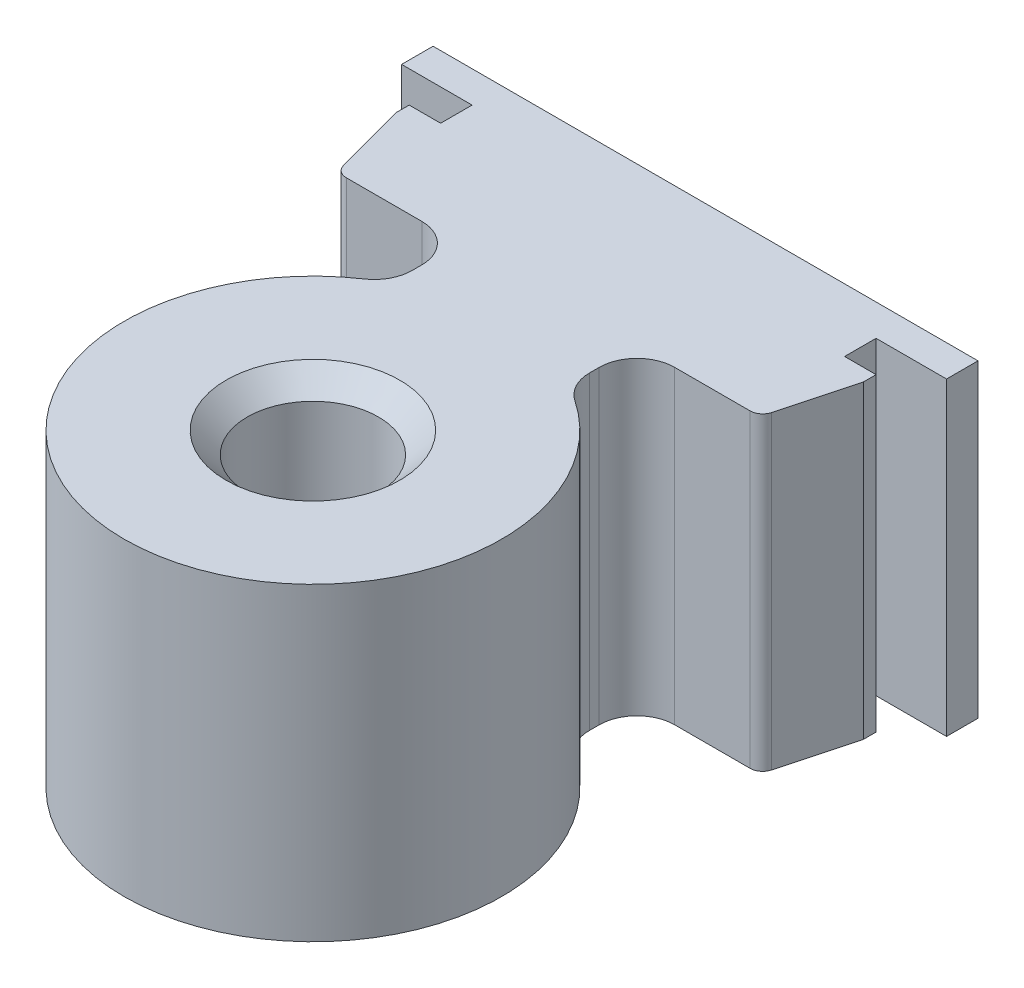
ISO-10303-21;
HEADER;
FILE_DESCRIPTION(('STEP AP214'),'2;1');
FILE_NAME('part.step','',(''),(''),'','','');
FILE_SCHEMA(('AUTOMOTIVE_DESIGN { 1 0 10303 214 1 1 1 1 }'));
ENDSEC;
DATA;
#1=APPLICATION_CONTEXT('core data for automotive mechanical design processes');
#2=APPLICATION_PROTOCOL_DEFINITION('international standard','automotive_design',2000,#1);
#3=PRODUCT_CONTEXT('',#1,'mechanical');
#4=PRODUCT('Part','Part','',(#3));
#5=PRODUCT_RELATED_PRODUCT_CATEGORY('part','',(#4));
#6=PRODUCT_DEFINITION_FORMATION('','',#4);
#7=PRODUCT_DEFINITION_CONTEXT('part definition',#1,'design');
#8=PRODUCT_DEFINITION('design','',#6,#7);
#9=PRODUCT_DEFINITION_SHAPE('','',#8);
#10=(LENGTH_UNIT() NAMED_UNIT(*) SI_UNIT(.MILLI.,.METRE.));
#11=(NAMED_UNIT(*) PLANE_ANGLE_UNIT() SI_UNIT($,.RADIAN.));
#12=(NAMED_UNIT(*) SI_UNIT($,.STERADIAN.) SOLID_ANGLE_UNIT());
#13=UNCERTAINTY_MEASURE_WITH_UNIT(LENGTH_MEASURE(1.E-05),#10,'distance_accuracy_value','');
#14=(GEOMETRIC_REPRESENTATION_CONTEXT(3) GLOBAL_UNCERTAINTY_ASSIGNED_CONTEXT((#13)) GLOBAL_UNIT_ASSIGNED_CONTEXT((#10,
#11,#12)) REPRESENTATION_CONTEXT('',''));
#15=CARTESIAN_POINT('',(0.,0.,0.));
#16=DIRECTION('',(0.,0.,1.));
#17=DIRECTION('',(1.,0.,0.));
#18=AXIS2_PLACEMENT_3D('',#15,#16,#17);
#19=CARTESIAN_POINT('',(-4.71170655987742,0.,1.52400483745604));
#20=DIRECTION('',(-1.,0.,0.));
#21=DIRECTION('',(0.,-1.,0.));
#22=AXIS2_PLACEMENT_3D('',#19,#20,#21);
#23=PLANE('',#22);
#24=DIRECTION('',(0.,0.,1.));
#25=VECTOR('',#24,1.);
#26=CARTESIAN_POINT('',(-4.71170655987742,0.,1.52400483745604));
#27=LINE('',#26,#25);
#28=CARTESIAN_POINT('',(-4.71170655987742,0.,1.27000483745604));
#29=VERTEX_POINT('',#28);
#30=CARTESIAN_POINT('',(-4.71170655987742,0.,1.52400483745604));
#31=VERTEX_POINT('',#30);
#32=EDGE_CURVE('E189',#29,#31,#27,.T.);
#33=ORIENTED_EDGE('',*,*,#32,.T.);
#34=DIRECTION('',(0.,1.,0.));
#35=VECTOR('',#34,1.);
#36=CARTESIAN_POINT('',(-4.71170655987742,0.,1.52400483745604));
#37=LINE('',#36,#35);
#38=CARTESIAN_POINT('',(-4.71170655987742,6.2484,1.52400483745604));
#39=VERTEX_POINT('',#38);
#40=EDGE_CURVE('E171',#39,#31,#37,.F.);
#41=ORIENTED_EDGE('',*,*,#40,.F.);
#42=DIRECTION('',(0.,0.,1.));
#43=VECTOR('',#42,1.);
#44=CARTESIAN_POINT('',(-4.71170655987742,6.2484,1.52400483745604));
#45=LINE('',#44,#43);
#46=CARTESIAN_POINT('',(-4.71170655987742,6.2484,1.27000483745604));
#47=VERTEX_POINT('',#46);
#48=EDGE_CURVE('E198',#39,#47,#45,.F.);
#49=ORIENTED_EDGE('',*,*,#48,.T.);
#50=DIRECTION('',(0.,1.,0.));
#51=VECTOR('',#50,1.);
#52=CARTESIAN_POINT('',(-4.71170655987742,0.,1.27000483745604));
#53=LINE('',#52,#51);
#54=EDGE_CURVE('E164',#29,#47,#53,.T.);
#55=ORIENTED_EDGE('',*,*,#54,.F.);
#56=EDGE_LOOP('',(#33,#41,#49,#55));
#57=FACE_BOUND('',#56,.T.);
#58=ADVANCED_FACE('F16',(#57),#23,.T.);
#59=CARTESIAN_POINT('',(4.71169344012258,0.,1.27000483745604));
#60=DIRECTION('',(1.,0.,0.));
#61=DIRECTION('',(0.,1.,0.));
#62=AXIS2_PLACEMENT_3D('',#59,#60,#61);
#63=PLANE('',#62);
#64=DIRECTION('',(0.,0.,1.));
#65=VECTOR('',#64,1.);
#66=CARTESIAN_POINT('',(4.71169344012258,0.,1.27000483745604));
#67=LINE('',#66,#65);
#68=CARTESIAN_POINT('',(4.71169344012258,0.,1.52400483745604));
#69=VERTEX_POINT('',#68);
#70=CARTESIAN_POINT('',(4.71169344012258,0.,1.27000483745604));
#71=VERTEX_POINT('',#70);
#72=EDGE_CURVE('E175',#69,#71,#67,.F.);
#73=ORIENTED_EDGE('',*,*,#72,.T.);
#74=DIRECTION('',(0.,1.,0.));
#75=VECTOR('',#74,1.);
#76=CARTESIAN_POINT('',(4.71169344012258,0.,1.27000483745604));
#77=LINE('',#76,#75);
#78=CARTESIAN_POINT('',(4.71169344012258,6.2484,1.27000483745604));
#79=VERTEX_POINT('',#78);
#80=EDGE_CURVE('E209',#79,#71,#77,.F.);
#81=ORIENTED_EDGE('',*,*,#80,.F.);
#82=DIRECTION('',(0.,0.,1.));
#83=VECTOR('',#82,1.);
#84=CARTESIAN_POINT('',(4.71169344012258,6.2484,1.27000483745604));
#85=LINE('',#84,#83);
#86=CARTESIAN_POINT('',(4.71169344012258,6.2484,1.52400483745604));
#87=VERTEX_POINT('',#86);
#88=EDGE_CURVE('E184',#79,#87,#85,.T.);
#89=ORIENTED_EDGE('',*,*,#88,.T.);
#90=DIRECTION('',(0.,1.,0.));
#91=VECTOR('',#90,1.);
#92=CARTESIAN_POINT('',(4.71169344012258,0.,1.52400483745604));
#93=LINE('',#92,#91);
#94=EDGE_CURVE('E129',#69,#87,#93,.T.);
#95=ORIENTED_EDGE('',*,*,#94,.F.);
#96=EDGE_LOOP('',(#73,#81,#89,#95));
#97=FACE_BOUND('',#96,.T.);
#98=ADVANCED_FACE('F415',(#97),#63,.T.);
#99=CARTESIAN_POINT('',(-4.31975915987742,0.,2.98674003745604));
#100=DIRECTION('',(-0.965924392574465,0.,0.258824395738983));
#101=DIRECTION('',(0.258824395738983,0.,0.965924392574465));
#102=AXIS2_PLACEMENT_3D('',#99,#100,#101);
#103=PLANE('',#102);
#104=DIRECTION('',(0.258824395738983,0.,0.965924392574465));
#105=VECTOR('',#104,1.);
#106=CARTESIAN_POINT('',(-4.31975915987742,0.,2.98674003745604));
#107=LINE('',#106,#105);
#108=CARTESIAN_POINT('',(-4.31975897779379,0.,2.98674071698637));
#109=VERTEX_POINT('',#108);
#110=EDGE_CURVE('E168',#31,#109,#107,.T.);
#111=ORIENTED_EDGE('',*,*,#110,.T.);
#112=DIRECTION('',(0.,1.,0.));
#113=VECTOR('',#112,1.);
#114=CARTESIAN_POINT('',(-4.31975915987742,0.,2.98674003745604));
#115=LINE('',#114,#113);
#116=CARTESIAN_POINT('',(-4.31975897779378,6.2484,2.98674071698637));
#117=VERTEX_POINT('',#116);
#118=EDGE_CURVE('E128',#117,#109,#115,.F.);
#119=ORIENTED_EDGE('',*,*,#118,.F.);
#120=DIRECTION('',(0.258824395738983,0.,0.965924392574465));
#121=VECTOR('',#120,1.);
#122=CARTESIAN_POINT('',(-4.31975915987742,6.2484,2.98674003745604));
#123=LINE('',#122,#121);
#124=EDGE_CURVE('E124',#117,#39,#123,.F.);
#125=ORIENTED_EDGE('',*,*,#124,.T.);
#126=ORIENTED_EDGE('',*,*,#40,.T.);
#127=EDGE_LOOP('',(#111,#119,#125,#126));
#128=FACE_BOUND('',#127,.T.);
#129=ADVANCED_FACE('F492',(#128),#103,.T.);
#130=CARTESIAN_POINT('',(4.07669344012258,0.,1.27000483745604));
#131=DIRECTION('',(0.,0.,-1.));
#132=DIRECTION('',(0.,1.,0.));
#133=AXIS2_PLACEMENT_3D('',#130,#131,#132);
#134=PLANE('',#133);
#135=DIRECTION('',(1.,0.,0.));
#136=VECTOR('',#135,1.);
#137=CARTESIAN_POINT('',(4.07669344012258,0.,1.27000483745604));
#138=LINE('',#137,#136);
#139=CARTESIAN_POINT('',(4.07669344012258,0.,1.27000483745604));
#140=VERTEX_POINT('',#139);
#141=EDGE_CURVE('E205',#71,#140,#138,.F.);
#142=ORIENTED_EDGE('',*,*,#141,.T.);
#143=DIRECTION('',(0.,1.,0.));
#144=VECTOR('',#143,1.);
#145=CARTESIAN_POINT('',(4.07669344012258,0.,1.27000483745604));
#146=LINE('',#145,#144);
#147=CARTESIAN_POINT('',(4.07669344012258,6.2484,1.27000483745604));
#148=VERTEX_POINT('',#147);
#149=EDGE_CURVE('E279',#148,#140,#146,.F.);
#150=ORIENTED_EDGE('',*,*,#149,.F.);
#151=DIRECTION('',(1.,0.,0.));
#152=VECTOR('',#151,1.);
#153=CARTESIAN_POINT('',(4.07669344012258,6.2484,1.27000483745604));
#154=LINE('',#153,#152);
#155=EDGE_CURVE('E170',#148,#79,#154,.T.);
#156=ORIENTED_EDGE('',*,*,#155,.T.);
#157=ORIENTED_EDGE('',*,*,#80,.T.);
#158=EDGE_LOOP('',(#142,#150,#156,#157));
#159=FACE_BOUND('',#158,.T.);
#160=ADVANCED_FACE('F490',(#159),#134,.T.);
#161=CARTESIAN_POINT('',(-4.71170655987742,0.,1.27000483745604));
#162=DIRECTION('',(0.,0.,-1.));
#163=DIRECTION('',(0.,1.,0.));
#164=AXIS2_PLACEMENT_3D('',#161,#162,#163);
#165=PLANE('',#164);
#166=DIRECTION('',(1.,0.,0.));
#167=VECTOR('',#166,1.);
#168=CARTESIAN_POINT('',(-4.71170655987742,0.,1.27000483745604));
#169=LINE('',#168,#167);
#170=CARTESIAN_POINT('',(-4.07670655987742,0.,1.27000483745604));
#171=VERTEX_POINT('',#170);
#172=EDGE_CURVE('E222',#171,#29,#169,.F.);
#173=ORIENTED_EDGE('',*,*,#172,.T.);
#174=ORIENTED_EDGE('',*,*,#54,.T.);
#175=DIRECTION('',(1.,0.,0.));
#176=VECTOR('',#175,1.);
#177=CARTESIAN_POINT('',(-4.71170655987742,6.2484,1.27000483745604));
#178=LINE('',#177,#176);
#179=CARTESIAN_POINT('',(-4.07670655987742,6.2484,1.27000483745604));
#180=VERTEX_POINT('',#179);
#181=EDGE_CURVE('E208',#47,#180,#178,.T.);
#182=ORIENTED_EDGE('',*,*,#181,.T.);
#183=DIRECTION('',(0.,-1.,0.));
#184=VECTOR('',#183,1.);
#185=CARTESIAN_POINT('',(-4.07670655987742,0.,1.27000483745604));
#186=LINE('',#185,#184);
#187=EDGE_CURVE('E276',#171,#180,#186,.F.);
#188=ORIENTED_EDGE('',*,*,#187,.F.);
#189=EDGE_LOOP('',(#173,#174,#182,#188));
#190=FACE_BOUND('',#189,.T.);
#191=ADVANCED_FACE('F438',(#190),#165,.T.);
#192=CARTESIAN_POINT('',(4.71169344012258,0.,1.52400483745604));
#193=DIRECTION('',(0.965924392574465,0.,0.258824395738983));
#194=DIRECTION('',(0.258824395738983,0.,-0.965924392574465));
#195=AXIS2_PLACEMENT_3D('',#192,#193,#194);
#196=PLANE('',#195);
#197=DIRECTION('',(0.258824395738983,0.,-0.965924392574465));
#198=VECTOR('',#197,1.);
#199=CARTESIAN_POINT('',(4.71169344012258,0.,1.52400483745604));
#200=LINE('',#199,#198);
#201=CARTESIAN_POINT('',(4.31974585803894,0.,2.98674071698637));
#202=VERTEX_POINT('',#201);
#203=EDGE_CURVE('E156',#202,#69,#200,.T.);
#204=ORIENTED_EDGE('',*,*,#203,.T.);
#205=ORIENTED_EDGE('',*,*,#94,.T.);
#206=DIRECTION('',(0.258824395738983,0.,-0.965924392574465));
#207=VECTOR('',#206,1.);
#208=CARTESIAN_POINT('',(4.71169344012258,6.2484,1.52400483745604));
#209=LINE('',#208,#207);
#210=CARTESIAN_POINT('',(4.31974585803894,6.2484,2.98674071698637));
#211=VERTEX_POINT('',#210);
#212=EDGE_CURVE('E159',#87,#211,#209,.F.);
#213=ORIENTED_EDGE('',*,*,#212,.T.);
#214=DIRECTION('',(0.,1.,0.));
#215=VECTOR('',#214,1.);
#216=CARTESIAN_POINT('',(4.31974604012258,0.,2.98674003745604));
#217=LINE('',#216,#215);
#218=EDGE_CURVE('E143',#202,#211,#217,.T.);
#219=ORIENTED_EDGE('',*,*,#218,.F.);
#220=EDGE_LOOP('',(#204,#205,#213,#219));
#221=FACE_BOUND('',#220,.T.);
#222=ADVANCED_FACE('F409',(#221),#196,.T.);
#223=CARTESIAN_POINT('',(-4.074414,0.,2.921));
#224=DIRECTION('',(0.,1.,0.));
#225=DIRECTION('',(-1.,0.,0.));
#226=AXIS2_PLACEMENT_3D('',#223,#224,#225);
#227=CYLINDRICAL_SURFACE('',#226,0.254000000000001);
#228=CARTESIAN_POINT('',(-4.074414,0.,2.921));
#229=DIRECTION('',(0.,1.,0.));
#230=DIRECTION('',(-1.,0.,0.));
#231=AXIS2_PLACEMENT_3D('',#228,#229,#230);
#232=CIRCLE('',#231,0.254000000000001);
#233=CARTESIAN_POINT('',(-4.074414,0.,3.175));
#234=VERTEX_POINT('',#233);
#235=EDGE_CURVE('E134',#109,#234,#232,.T.);
#236=ORIENTED_EDGE('',*,*,#235,.T.);
#237=DIRECTION('',(0.,-1.,0.));
#238=VECTOR('',#237,1.);
#239=CARTESIAN_POINT('',(-4.074414,0.,3.175));
#240=LINE('',#239,#238);
#241=CARTESIAN_POINT('',(-4.074414,6.2484,3.175));
#242=VERTEX_POINT('',#241);
#243=EDGE_CURVE('E131',#242,#234,#240,.T.);
#244=ORIENTED_EDGE('',*,*,#243,.F.);
#245=CARTESIAN_POINT('',(-4.074414,6.2484,2.921));
#246=DIRECTION('',(0.,1.,0.));
#247=DIRECTION('',(-1.,0.,0.));
#248=AXIS2_PLACEMENT_3D('',#245,#246,#247);
#249=CIRCLE('',#248,0.254000000000001);
#250=EDGE_CURVE('E20',#242,#117,#249,.F.);
#251=ORIENTED_EDGE('',*,*,#250,.T.);
#252=ORIENTED_EDGE('',*,*,#118,.T.);
#253=EDGE_LOOP('',(#236,#244,#251,#252));
#254=FACE_BOUND('',#253,.T.);
#255=ADVANCED_FACE('F132',(#254),#227,.T.);
#256=CARTESIAN_POINT('',(4.07669344012258,0.,0.635004837456041));
#257=DIRECTION('',(1.,0.,0.));
#258=DIRECTION('',(0.,1.,0.));
#259=AXIS2_PLACEMENT_3D('',#256,#257,#258);
#260=PLANE('',#259);
#261=DIRECTION('',(0.,0.,1.));
#262=VECTOR('',#261,1.);
#263=CARTESIAN_POINT('',(4.07669344012258,0.,0.635004837456041));
#264=LINE('',#263,#262);
#265=CARTESIAN_POINT('',(4.07669344012258,0.,0.635004837456041));
#266=VERTEX_POINT('',#265);
#267=EDGE_CURVE('E285',#140,#266,#264,.F.);
#268=ORIENTED_EDGE('',*,*,#267,.T.);
#269=DIRECTION('',(0.,-1.,0.));
#270=VECTOR('',#269,1.);
#271=CARTESIAN_POINT('',(4.07669344012258,0.,0.635004837456041));
#272=LINE('',#271,#270);
#273=CARTESIAN_POINT('',(4.07669344012258,6.2484,0.635004837456041));
#274=VERTEX_POINT('',#273);
#275=EDGE_CURVE('E301',#274,#266,#272,.T.);
#276=ORIENTED_EDGE('',*,*,#275,.F.);
#277=DIRECTION('',(0.,0.,1.));
#278=VECTOR('',#277,1.);
#279=CARTESIAN_POINT('',(4.07669344012258,6.2484,0.635004837456041));
#280=LINE('',#279,#278);
#281=EDGE_CURVE('E277',#274,#148,#280,.T.);
#282=ORIENTED_EDGE('',*,*,#281,.T.);
#283=ORIENTED_EDGE('',*,*,#149,.T.);
#284=EDGE_LOOP('',(#268,#276,#282,#283));
#285=FACE_BOUND('',#284,.T.);
#286=ADVANCED_FACE('F488',(#285),#260,.T.);
#287=CARTESIAN_POINT('',(-4.07670655987742,0.,1.27000483745604));
#288=DIRECTION('',(-1.,0.,0.));
#289=DIRECTION('',(0.,-1.,0.));
#290=AXIS2_PLACEMENT_3D('',#287,#288,#289);
#291=PLANE('',#290);
#292=DIRECTION('',(0.,0.,1.));
#293=VECTOR('',#292,1.);
#294=CARTESIAN_POINT('',(-4.07670655987742,0.,1.27000483745604));
#295=LINE('',#294,#293);
#296=CARTESIAN_POINT('',(-4.07670655987742,0.,0.635004837456041));
#297=VERTEX_POINT('',#296);
#298=EDGE_CURVE('E291',#297,#171,#295,.T.);
#299=ORIENTED_EDGE('',*,*,#298,.T.);
#300=ORIENTED_EDGE('',*,*,#187,.T.);
#301=DIRECTION('',(0.,0.,1.));
#302=VECTOR('',#301,1.);
#303=CARTESIAN_POINT('',(-4.07670655987742,6.2484,1.27000483745604));
#304=LINE('',#303,#302);
#305=CARTESIAN_POINT('',(-4.07670655987742,6.2484,0.635004837456041));
#306=VERTEX_POINT('',#305);
#307=EDGE_CURVE('E294',#180,#306,#304,.F.);
#308=ORIENTED_EDGE('',*,*,#307,.T.);
#309=DIRECTION('',(0.,-1.,0.));
#310=VECTOR('',#309,1.);
#311=CARTESIAN_POINT('',(-4.07670655987742,0.,0.635004837456041));
#312=LINE('',#311,#310);
#313=EDGE_CURVE('E307',#297,#306,#312,.F.);
#314=ORIENTED_EDGE('',*,*,#313,.F.);
#315=EDGE_LOOP('',(#299,#300,#308,#314));
#316=FACE_BOUND('',#315,.T.);
#317=ADVANCED_FACE('F556',(#316),#291,.T.);
#318=CARTESIAN_POINT('',(4.07440088024515,0.,2.921));
#319=DIRECTION('',(0.,1.,0.));
#320=DIRECTION('',(-1.,0.,0.));
#321=AXIS2_PLACEMENT_3D('',#318,#319,#320);
#322=CYLINDRICAL_SURFACE('',#321,0.254000000000001);
#323=CARTESIAN_POINT('',(4.07440088024515,0.,2.921));
#324=DIRECTION('',(0.,1.,0.));
#325=DIRECTION('',(-1.,0.,0.));
#326=AXIS2_PLACEMENT_3D('',#323,#324,#325);
#327=CIRCLE('',#326,0.254000000000001);
#328=CARTESIAN_POINT('',(4.07440088024515,0.,3.175));
#329=VERTEX_POINT('',#328);
#330=EDGE_CURVE('E146',#329,#202,#327,.T.);
#331=ORIENTED_EDGE('',*,*,#330,.T.);
#332=ORIENTED_EDGE('',*,*,#218,.T.);
#333=CARTESIAN_POINT('',(4.07440088024515,6.2484,2.921));
#334=DIRECTION('',(0.,1.,0.));
#335=DIRECTION('',(-1.,0.,0.));
#336=AXIS2_PLACEMENT_3D('',#333,#334,#335);
#337=CIRCLE('',#336,0.254000000000001);
#338=CARTESIAN_POINT('',(4.07440088024515,6.2484,3.175));
#339=VERTEX_POINT('',#338);
#340=EDGE_CURVE('E274',#211,#339,#337,.F.);
#341=ORIENTED_EDGE('',*,*,#340,.T.);
#342=DIRECTION('',(0.,-1.,0.));
#343=VECTOR('',#342,1.);
#344=CARTESIAN_POINT('',(4.07440088024515,0.,3.175));
#345=LINE('',#344,#343);
#346=EDGE_CURVE('E151',#329,#339,#345,.F.);
#347=ORIENTED_EDGE('',*,*,#346,.F.);
#348=EDGE_LOOP('',(#331,#332,#341,#347));
#349=FACE_BOUND('',#348,.T.);
#350=ADVANCED_FACE('F404',(#349),#322,.T.);
#351=CARTESIAN_POINT('',(-2.5527,0.,3.175));
#352=DIRECTION('',(0.,0.,1.));
#353=DIRECTION('',(0.,-1.,0.));
#354=AXIS2_PLACEMENT_3D('',#351,#352,#353);
#355=PLANE('',#354);
#356=DIRECTION('',(1.,0.,0.));
#357=VECTOR('',#356,1.);
#358=CARTESIAN_POINT('',(-2.5527,0.,3.175));
#359=LINE('',#358,#357);
#360=CARTESIAN_POINT('',(-2.5527,0.,3.17500000005667));
#361=VERTEX_POINT('',#360);
#362=EDGE_CURVE('E137',#234,#361,#359,.T.);
#363=ORIENTED_EDGE('',*,*,#362,.T.);
#364=DIRECTION('',(0.,1.,0.));
#365=VECTOR('',#364,1.);
#366=CARTESIAN_POINT('',(-2.5527,0.,3.17500000011334));
#367=LINE('',#366,#365);
#368=CARTESIAN_POINT('',(-2.5527,6.2484,3.17500000005667));
#369=VERTEX_POINT('',#368);
#370=EDGE_CURVE('E141',#369,#361,#367,.F.);
#371=ORIENTED_EDGE('',*,*,#370,.F.);
#372=DIRECTION('',(1.,0.,0.));
#373=VECTOR('',#372,1.);
#374=CARTESIAN_POINT('',(-2.5527,6.2484,3.175));
#375=LINE('',#374,#373);
#376=EDGE_CURVE('E121',#369,#242,#375,.F.);
#377=ORIENTED_EDGE('',*,*,#376,.T.);
#378=ORIENTED_EDGE('',*,*,#243,.T.);
#379=EDGE_LOOP('',(#363,#371,#377,#378));
#380=FACE_BOUND('',#379,.T.);
#381=ADVANCED_FACE('F139',(#380),#355,.T.);
#382=CARTESIAN_POINT('',(5.49909344012258,0.,0.635004837456041));
#383=DIRECTION('',(0.,0.,1.));
#384=DIRECTION('',(0.,-1.,0.));
#385=AXIS2_PLACEMENT_3D('',#382,#383,#384);
#386=PLANE('',#385);
#387=DIRECTION('',(1.,0.,0.));
#388=VECTOR('',#387,1.);
#389=CARTESIAN_POINT('',(5.49909344012258,0.,0.635004837456041));
#390=LINE('',#389,#388);
#391=CARTESIAN_POINT('',(5.49909344012258,0.,0.635004837456041));
#392=VERTEX_POINT('',#391);
#393=EDGE_CURVE('E297',#266,#392,#390,.T.);
#394=ORIENTED_EDGE('',*,*,#393,.T.);
#395=DIRECTION('',(0.,1.,0.));
#396=VECTOR('',#395,1.);
#397=CARTESIAN_POINT('',(5.49909344012258,0.,0.635004837456041));
#398=LINE('',#397,#396);
#399=CARTESIAN_POINT('',(5.49909344012258,6.2484,0.635004837456041));
#400=VERTEX_POINT('',#399);
#401=EDGE_CURVE('E320',#400,#392,#398,.F.);
#402=ORIENTED_EDGE('',*,*,#401,.F.);
#403=DIRECTION('',(1.,0.,0.));
#404=VECTOR('',#403,1.);
#405=CARTESIAN_POINT('',(5.49909344012258,6.2484,0.635004837456041));
#406=LINE('',#405,#404);
#407=EDGE_CURVE('E304',#400,#274,#406,.F.);
#408=ORIENTED_EDGE('',*,*,#407,.T.);
#409=ORIENTED_EDGE('',*,*,#275,.T.);
#410=EDGE_LOOP('',(#394,#402,#408,#409));
#411=FACE_BOUND('',#410,.T.);
#412=ADVANCED_FACE('F485',(#411),#386,.T.);
#413=CARTESIAN_POINT('',(-4.07670655987742,0.,0.635004837456041));
#414=DIRECTION('',(0.,0.,1.));
#415=DIRECTION('',(0.,-1.,0.));
#416=AXIS2_PLACEMENT_3D('',#413,#414,#415);
#417=PLANE('',#416);
#418=DIRECTION('',(1.,0.,0.));
#419=VECTOR('',#418,1.);
#420=CARTESIAN_POINT('',(-4.07670655987742,0.,0.635004837456041));
#421=LINE('',#420,#419);
#422=CARTESIAN_POINT('',(-5.49910655987742,0.,0.635004837456041));
#423=VERTEX_POINT('',#422);
#424=EDGE_CURVE('E311',#423,#297,#421,.T.);
#425=ORIENTED_EDGE('',*,*,#424,.T.);
#426=ORIENTED_EDGE('',*,*,#313,.T.);
#427=DIRECTION('',(1.,0.,0.));
#428=VECTOR('',#427,1.);
#429=CARTESIAN_POINT('',(-4.07670655987742,6.2484,0.635004837456041));
#430=LINE('',#429,#428);
#431=CARTESIAN_POINT('',(-5.49910655987742,6.2484,0.635004837456041));
#432=VERTEX_POINT('',#431);
#433=EDGE_CURVE('E300',#306,#432,#430,.F.);
#434=ORIENTED_EDGE('',*,*,#433,.T.);
#435=DIRECTION('',(0.,-1.,0.));
#436=VECTOR('',#435,1.);
#437=CARTESIAN_POINT('',(-5.49910655987742,0.,0.635004837456041));
#438=LINE('',#437,#436);
#439=EDGE_CURVE('E267',#423,#432,#438,.F.);
#440=ORIENTED_EDGE('',*,*,#439,.F.);
#441=EDGE_LOOP('',(#425,#426,#434,#440));
#442=FACE_BOUND('',#441,.T.);
#443=ADVANCED_FACE('F546',(#442),#417,.T.);
#444=CARTESIAN_POINT('',(4.07440088024515,0.,3.175));
#445=DIRECTION('',(0.,0.,1.));
#446=DIRECTION('',(0.,-1.,0.));
#447=AXIS2_PLACEMENT_3D('',#444,#445,#446);
#448=PLANE('',#447);
#449=DIRECTION('',(1.,0.,0.));
#450=VECTOR('',#449,1.);
#451=CARTESIAN_POINT('',(4.07440088024515,0.,3.175));
#452=LINE('',#451,#450);
#453=CARTESIAN_POINT('',(2.55268688024515,0.,3.175));
#454=VERTEX_POINT('',#453);
#455=EDGE_CURVE('E154',#454,#329,#452,.T.);
#456=ORIENTED_EDGE('',*,*,#455,.T.);
#457=ORIENTED_EDGE('',*,*,#346,.T.);
#458=DIRECTION('',(1.,0.,0.));
#459=VECTOR('',#458,1.);
#460=CARTESIAN_POINT('',(4.07440088024515,6.2484,3.175));
#461=LINE('',#460,#459);
#462=CARTESIAN_POINT('',(2.55268688024515,6.2484,3.175));
#463=VERTEX_POINT('',#462);
#464=EDGE_CURVE('E310',#339,#463,#461,.F.);
#465=ORIENTED_EDGE('',*,*,#464,.T.);
#466=DIRECTION('',(0.,1.,0.));
#467=VECTOR('',#466,1.);
#468=CARTESIAN_POINT('',(2.55268688024515,0.,3.175));
#469=LINE('',#468,#467);
#470=EDGE_CURVE('E264',#454,#463,#469,.T.);
#471=ORIENTED_EDGE('',*,*,#470,.F.);
#472=EDGE_LOOP('',(#456,#457,#465,#471));
#473=FACE_BOUND('',#472,.T.);
#474=ADVANCED_FACE('F396',(#473),#448,.T.);
#475=CARTESIAN_POINT('',(-2.55271314279456,0.,3.937));
#476=DIRECTION('',(0.,1.,0.));
#477=DIRECTION('',(-1.,0.,0.));
#478=AXIS2_PLACEMENT_3D('',#475,#476,#477);
#479=CYLINDRICAL_SURFACE('',#478,0.762000000000001);
#480=CARTESIAN_POINT('',(-2.55271314279456,0.,3.937));
#481=DIRECTION('',(0.,1.,0.));
#482=DIRECTION('',(-1.,0.,0.));
#483=AXIS2_PLACEMENT_3D('',#480,#481,#482);
#484=CIRCLE('',#483,0.762000000000001);
#485=CARTESIAN_POINT('',(-1.79071314279456,0.,3.937));
#486=VERTEX_POINT('',#485);
#487=EDGE_CURVE('E268',#361,#486,#484,.F.);
#488=ORIENTED_EDGE('',*,*,#487,.T.);
#489=DIRECTION('',(0.,-1.,0.));
#490=VECTOR('',#489,1.);
#491=CARTESIAN_POINT('',(-1.79071314279456,0.,3.937));
#492=LINE('',#491,#490);
#493=CARTESIAN_POINT('',(-1.79071314279456,6.2484,3.937));
#494=VERTEX_POINT('',#493);
#495=EDGE_CURVE('E359',#494,#486,#492,.T.);
#496=ORIENTED_EDGE('',*,*,#495,.F.);
#497=CARTESIAN_POINT('',(-2.55271314279456,6.2484,3.937));
#498=DIRECTION('',(0.,1.,0.));
#499=DIRECTION('',(-1.,0.,0.));
#500=AXIS2_PLACEMENT_3D('',#497,#498,#499);
#501=CIRCLE('',#500,0.762000000000001);
#502=EDGE_CURVE('E153',#494,#369,#501,.T.);
#503=ORIENTED_EDGE('',*,*,#502,.T.);
#504=ORIENTED_EDGE('',*,*,#370,.T.);
#505=EDGE_LOOP('',(#488,#496,#503,#504));
#506=FACE_BOUND('',#505,.T.);
#507=ADVANCED_FACE('F373',(#506),#479,.F.);
#508=CARTESIAN_POINT('',(0.,0.42926,7.9248));
#509=DIRECTION('',(0.,1.,0.));
#510=DIRECTION('',(0.,0.,1.));
#511=AXIS2_PLACEMENT_3D('',#508,#509,#510);
#512=CYLINDRICAL_SURFACE('',#511,1.32334);
#513=CARTESIAN_POINT('',(0.,0.429260000089471,7.9248));
#514=DIRECTION('',(0.,-1.,0.));
#515=DIRECTION('',(-1.,0.,0.));
#516=AXIS2_PLACEMENT_3D('',#513,#514,#515);
#517=CIRCLE('',#516,1.32333999999901);
#518=CARTESIAN_POINT('',(-1.32333999999901,0.429260000089471,7.9248));
#519=VERTEX_POINT('',#518);
#520=EDGE_CURVE('E338',#519,#519,#517,.F.);
#521=ORIENTED_EDGE('',*,*,#520,.F.);
#522=EDGE_LOOP('',(#521));
#523=FACE_BOUND('',#522,.T.);
#524=CARTESIAN_POINT('',(0.,5.81914000002826,7.9248));
#525=DIRECTION('',(0.,1.,0.));
#526=DIRECTION('',(-1.,0.,0.));
#527=AXIS2_PLACEMENT_3D('',#524,#525,#526);
#528=CIRCLE('',#527,1.32333999999901);
#529=CARTESIAN_POINT('',(-1.32333999999901,5.81914000002826,7.9248));
#530=VERTEX_POINT('',#529);
#531=EDGE_CURVE('E362',#530,#530,#528,.F.);
#532=ORIENTED_EDGE('',*,*,#531,.F.);
#533=EDGE_LOOP('',(#532));
#534=FACE_BOUND('',#533,.T.);
#535=ADVANCED_FACE('F538',(#523,#534),#512,.F.);
#536=CARTESIAN_POINT('',(5.49909344012258,0.,4.8374560404435E-06));
#537=DIRECTION('',(1.,0.,0.));
#538=DIRECTION('',(0.,1.,0.));
#539=AXIS2_PLACEMENT_3D('',#536,#537,#538);
#540=PLANE('',#539);
#541=DIRECTION('',(0.,0.,1.));
#542=VECTOR('',#541,1.);
#543=CARTESIAN_POINT('',(5.49909344012258,0.,4.8374560404435E-06));
#544=LINE('',#543,#542);
#545=CARTESIAN_POINT('',(5.49909344012258,0.,4.83745604052642E-06));
#546=VERTEX_POINT('',#545);
#547=EDGE_CURVE('E316',#392,#546,#544,.F.);
#548=ORIENTED_EDGE('',*,*,#547,.T.);
#549=DIRECTION('',(0.,1.,0.));
#550=VECTOR('',#549,1.);
#551=CARTESIAN_POINT('',(5.49909344012258,0.,4.8374560404435E-06));
#552=LINE('',#551,#550);
#553=CARTESIAN_POINT('',(5.49909344012258,6.2484,4.83745604062207E-06));
#554=VERTEX_POINT('',#553);
#555=EDGE_CURVE('E335',#554,#546,#552,.F.);
#556=ORIENTED_EDGE('',*,*,#555,.F.);
#557=DIRECTION('',(0.,0.,1.));
#558=VECTOR('',#557,1.);
#559=CARTESIAN_POINT('',(5.49909344012258,6.2484,4.8374560404435E-06));
#560=LINE('',#559,#558);
#561=EDGE_CURVE('E270',#554,#400,#560,.T.);
#562=ORIENTED_EDGE('',*,*,#561,.T.);
#563=ORIENTED_EDGE('',*,*,#401,.T.);
#564=EDGE_LOOP('',(#548,#556,#562,#563));
#565=FACE_BOUND('',#564,.T.);
#566=ADVANCED_FACE('F472',(#565),#540,.T.);
#567=CARTESIAN_POINT('',(-5.49910655987742,0.,0.635004837456041));
#568=DIRECTION('',(-1.,0.,0.));
#569=DIRECTION('',(0.,-1.,0.));
#570=AXIS2_PLACEMENT_3D('',#567,#568,#569);
#571=PLANE('',#570);
#572=DIRECTION('',(0.,0.,1.));
#573=VECTOR('',#572,1.);
#574=CARTESIAN_POINT('',(-5.49910655987742,0.,0.635004837456041));
#575=LINE('',#574,#573);
#576=CARTESIAN_POINT('',(-5.49910655987742,0.,4.83745604069226E-06));
#577=VERTEX_POINT('',#576);
#578=EDGE_CURVE('E327',#577,#423,#575,.T.);
#579=ORIENTED_EDGE('',*,*,#578,.T.);
#580=ORIENTED_EDGE('',*,*,#439,.T.);
#581=DIRECTION('',(0.,0.,1.));
#582=VECTOR('',#581,1.);
#583=CARTESIAN_POINT('',(-5.49910655987742,6.2484,0.635004837456041));
#584=LINE('',#583,#582);
#585=CARTESIAN_POINT('',(-5.49910655987742,6.2484,4.83745604078791E-06));
#586=VERTEX_POINT('',#585);
#587=EDGE_CURVE('E319',#432,#586,#584,.F.);
#588=ORIENTED_EDGE('',*,*,#587,.T.);
#589=DIRECTION('',(0.,1.,0.));
#590=VECTOR('',#589,1.);
#591=CARTESIAN_POINT('',(-5.49910655987742,0.,4.8374560404435E-06));
#592=LINE('',#591,#590);
#593=EDGE_CURVE('E332',#577,#586,#592,.T.);
#594=ORIENTED_EDGE('',*,*,#593,.F.);
#595=EDGE_LOOP('',(#579,#580,#588,#594));
#596=FACE_BOUND('',#595,.T.);
#597=ADVANCED_FACE('F482',(#596),#571,.T.);
#598=CARTESIAN_POINT('',(2.55268688024515,0.,3.937));
#599=DIRECTION('',(0.,1.,0.));
#600=DIRECTION('',(-1.,0.,0.));
#601=AXIS2_PLACEMENT_3D('',#598,#599,#600);
#602=CYLINDRICAL_SURFACE('',#601,0.762);
#603=CARTESIAN_POINT('',(2.55268688024515,0.,3.937));
#604=DIRECTION('',(0.,1.,0.));
#605=DIRECTION('',(-1.,0.,0.));
#606=AXIS2_PLACEMENT_3D('',#603,#604,#605);
#607=CIRCLE('',#606,0.762);
#608=CARTESIAN_POINT('',(1.79068688024515,0.,3.937));
#609=VERTEX_POINT('',#608);
#610=EDGE_CURVE('E261',#609,#454,#607,.F.);
#611=ORIENTED_EDGE('',*,*,#610,.T.);
#612=ORIENTED_EDGE('',*,*,#470,.T.);
#613=CARTESIAN_POINT('',(2.55268688024515,6.2484,3.937));
#614=DIRECTION('',(0.,1.,0.));
#615=DIRECTION('',(-1.,0.,0.));
#616=AXIS2_PLACEMENT_3D('',#613,#614,#615);
#617=CIRCLE('',#616,0.762);
#618=CARTESIAN_POINT('',(1.79068688024515,6.2484,3.937));
#619=VERTEX_POINT('',#618);
#620=EDGE_CURVE('E265',#463,#619,#617,.T.);
#621=ORIENTED_EDGE('',*,*,#620,.T.);
#622=DIRECTION('',(0.,1.,0.));
#623=VECTOR('',#622,1.);
#624=CARTESIAN_POINT('',(1.79068688024515,0.,3.937));
#625=LINE('',#624,#623);
#626=EDGE_CURVE('E260',#609,#619,#625,.T.);
#627=ORIENTED_EDGE('',*,*,#626,.F.);
#628=EDGE_LOOP('',(#611,#612,#621,#627));
#629=FACE_BOUND('',#628,.T.);
#630=ADVANCED_FACE('F398',(#629),#602,.F.);
#631=CARTESIAN_POINT('',(0.,5.81913999991457,7.9248));
#632=DIRECTION('',(0.,1.,0.));
#633=DIRECTION('',(0.,0.,1.));
#634=AXIS2_PLACEMENT_3D('',#631,#632,#633);
#635=CONICAL_SURFACE('',#634,1.32333999988532,0.785398163397448);
#636=ORIENTED_EDGE('',*,*,#531,.T.);
#637=EDGE_LOOP('',(#636));
#638=FACE_BOUND('',#637,.T.);
#639=CARTESIAN_POINT('',(0.,6.24840000006088,7.9248));
#640=DIRECTION('',(0.,1.,0.));
#641=DIRECTION('',(0.,0.,1.));
#642=AXIS2_PLACEMENT_3D('',#639,#640,#641);
#643=CIRCLE('',#642,1.75260000003163);
#644=CARTESIAN_POINT('',(0.,6.24840000006088,9.67740000003163));
#645=VERTEX_POINT('',#644);
#646=EDGE_CURVE('E256',#645,#645,#643,.F.);
#647=ORIENTED_EDGE('',*,*,#646,.F.);
#648=EDGE_LOOP('',(#647));
#649=FACE_BOUND('',#648,.T.);
#650=ADVANCED_FACE('F528',(#638,#649),#635,.F.);
#651=CARTESIAN_POINT('',(-1.79071314279456,0.,4.1317926));
#652=DIRECTION('',(-1.,0.,0.));
#653=DIRECTION('',(0.,-1.,0.));
#654=AXIS2_PLACEMENT_3D('',#651,#652,#653);
#655=PLANE('',#654);
#656=DIRECTION('',(0.,0.,1.));
#657=VECTOR('',#656,1.);
#658=CARTESIAN_POINT('',(-1.79071314279456,0.,4.1317926));
#659=LINE('',#658,#657);
#660=CARTESIAN_POINT('',(-1.79071314279456,0.,4.1317926));
#661=VERTEX_POINT('',#660);
#662=EDGE_CURVE('E357',#486,#661,#659,.T.);
#663=ORIENTED_EDGE('',*,*,#662,.T.);
#664=DIRECTION('',(0.,1.,0.));
#665=VECTOR('',#664,1.);
#666=CARTESIAN_POINT('',(-1.79071314279456,0.,4.1317926));
#667=LINE('',#666,#665);
#668=CARTESIAN_POINT('',(-1.79071314279456,6.2484,4.1317926));
#669=VERTEX_POINT('',#668);
#670=EDGE_CURVE('E251',#669,#661,#667,.F.);
#671=ORIENTED_EDGE('',*,*,#670,.F.);
#672=DIRECTION('',(0.,0.,1.));
#673=VECTOR('',#672,1.);
#674=CARTESIAN_POINT('',(-1.79071314279456,6.2484,4.18957771966602));
#675=LINE('',#674,#673);
#676=EDGE_CURVE('E259',#494,#669,#675,.T.);
#677=ORIENTED_EDGE('',*,*,#676,.F.);
#678=ORIENTED_EDGE('',*,*,#495,.T.);
#679=EDGE_LOOP('',(#663,#671,#677,#678));
#680=FACE_BOUND('',#679,.T.);
#681=ADVANCED_FACE('F381',(#680),#655,.T.);
#682=CARTESIAN_POINT('',(0.,0.429260000146314,7.9248));
#683=DIRECTION('',(0.,-1.,0.));
#684=DIRECTION('',(0.,0.,-1.));
#685=AXIS2_PLACEMENT_3D('',#682,#683,#684);
#686=CONICAL_SURFACE('',#685,1.32333999988532,0.785398163397448);
#687=CARTESIAN_POINT('',(0.,5.6843418860808E-11,7.9248));
#688=DIRECTION('',(0.,-1.,0.));
#689=DIRECTION('',(0.,0.,-1.));
#690=AXIS2_PLACEMENT_3D('',#687,#688,#689);
#691=CIRCLE('',#690,1.75259999997479);
#692=CARTESIAN_POINT('',(0.,5.68430598879198E-11,6.17220000002521));
#693=VERTEX_POINT('',#692);
#694=EDGE_CURVE('E248',#693,#693,#691,.T.);
#695=ORIENTED_EDGE('',*,*,#694,.T.);
#696=EDGE_LOOP('',(#695));
#697=FACE_BOUND('',#696,.T.);
#698=ORIENTED_EDGE('',*,*,#520,.T.);
#699=EDGE_LOOP('',(#698));
#700=FACE_BOUND('',#699,.T.);
#701=ADVANCED_FACE('F522',(#697,#700),#686,.F.);
#702=CARTESIAN_POINT('',(-5.49910655987742,0.,4.8374560404435E-06));
#703=DIRECTION('',(0.,0.,-1.));
#704=DIRECTION('',(0.,1.,0.));
#705=AXIS2_PLACEMENT_3D('',#702,#703,#704);
#706=PLANE('',#705);
#707=DIRECTION('',(1.,0.,0.));
#708=VECTOR('',#707,1.);
#709=CARTESIAN_POINT('',(-9.06835815926736E-06,0.,4.83745604077518E-06));
#710=LINE('',#709,#708);
#711=EDGE_CURVE('E244',#546,#577,#710,.F.);
#712=ORIENTED_EDGE('',*,*,#711,.T.);
#713=ORIENTED_EDGE('',*,*,#593,.T.);
#714=DIRECTION('',(1.,0.,0.));
#715=VECTOR('',#714,1.);
#716=CARTESIAN_POINT('',(-9.06835815848565E-06,6.2484,4.83745604077518E-06));
#717=LINE('',#716,#715);
#718=EDGE_CURVE('E255',#554,#586,#717,.F.);
#719=ORIENTED_EDGE('',*,*,#718,.F.);
#720=ORIENTED_EDGE('',*,*,#555,.T.);
#721=EDGE_LOOP('',(#712,#713,#719,#720));
#722=FACE_BOUND('',#721,.T.);
#723=ADVANCED_FACE('F478',(#722),#706,.T.);
#724=CARTESIAN_POINT('',(1.79068688024515,0.,3.937));
#725=DIRECTION('',(1.,0.,0.));
#726=DIRECTION('',(0.,1.,0.));
#727=AXIS2_PLACEMENT_3D('',#724,#725,#726);
#728=PLANE('',#727);
#729=DIRECTION('',(0.,0.,1.));
#730=VECTOR('',#729,1.);
#731=CARTESIAN_POINT('',(1.79068688024515,0.,4.18957771966601));
#732=LINE('',#731,#730);
#733=CARTESIAN_POINT('',(1.79068688024515,0.,4.1317926));
#734=VERTEX_POINT('',#733);
#735=EDGE_CURVE('E247',#734,#609,#732,.F.);
#736=ORIENTED_EDGE('',*,*,#735,.T.);
#737=ORIENTED_EDGE('',*,*,#626,.T.);
#738=DIRECTION('',(0.,0.,1.));
#739=VECTOR('',#738,1.);
#740=CARTESIAN_POINT('',(1.79068688024515,6.2484,4.18957771966602));
#741=LINE('',#740,#739);
#742=CARTESIAN_POINT('',(1.79068688024515,6.2484,4.1317926));
#743=VERTEX_POINT('',#742);
#744=EDGE_CURVE('E341',#743,#619,#741,.F.);
#745=ORIENTED_EDGE('',*,*,#744,.F.);
#746=DIRECTION('',(0.,1.,0.));
#747=VECTOR('',#746,1.);
#748=CARTESIAN_POINT('',(1.79068688024515,0.,4.1317926));
#749=LINE('',#748,#747);
#750=EDGE_CURVE('E239',#734,#743,#749,.T.);
#751=ORIENTED_EDGE('',*,*,#750,.F.);
#752=EDGE_LOOP('',(#736,#737,#745,#751));
#753=FACE_BOUND('',#752,.T.);
#754=ADVANCED_FACE('F391',(#753),#728,.T.);
#755=CARTESIAN_POINT('',(-9.06835815848565E-06,6.2484,4.18957771966602));
#756=DIRECTION('',(0.,1.,0.));
#757=DIRECTION('',(0.,0.,1.));
#758=AXIS2_PLACEMENT_3D('',#755,#756,#757);
#759=PLANE('',#758);
#760=ORIENTED_EDGE('',*,*,#48,.F.);
#761=ORIENTED_EDGE('',*,*,#124,.F.);
#762=ORIENTED_EDGE('',*,*,#250,.F.);
#763=ORIENTED_EDGE('',*,*,#376,.F.);
#764=ORIENTED_EDGE('',*,*,#502,.F.);
#765=ORIENTED_EDGE('',*,*,#676,.T.);
#766=CARTESIAN_POINT('',(-2.55271314279456,6.2484,4.1317926));
#767=DIRECTION('',(0.,1.,0.));
#768=DIRECTION('',(-1.,0.,0.));
#769=AXIS2_PLACEMENT_3D('',#766,#767,#768);
#770=CIRCLE('',#769,0.762000000000002);
#771=CARTESIAN_POINT('',(-2.12726314087458,6.2484,4.76396053327904));
#772=VERTEX_POINT('',#771);
#773=EDGE_CURVE('E252',#772,#669,#770,.T.);
#774=ORIENTED_EDGE('',*,*,#773,.F.);
#775=CARTESIAN_POINT('',(-1.31312747023613E-05,6.2484,7.92480019967424));
#776=DIRECTION('',(0.,1.,0.));
#777=DIRECTION('',(-1.,0.,0.));
#778=AXIS2_PLACEMENT_3D('',#775,#776,#777);
#779=CIRCLE('',#778,3.81);
#780=CARTESIAN_POINT('',(2.12723687832518,6.2484,4.76396053327904));
#781=VERTEX_POINT('',#780);
#782=EDGE_CURVE('E236',#781,#772,#779,.F.);
#783=ORIENTED_EDGE('',*,*,#782,.F.);
#784=CARTESIAN_POINT('',(2.55268688024515,6.2484,4.1317926));
#785=DIRECTION('',(0.,1.,0.));
#786=DIRECTION('',(-1.,0.,0.));
#787=AXIS2_PLACEMENT_3D('',#784,#785,#786);
#788=CIRCLE('',#787,0.762);
#789=EDGE_CURVE('E241',#743,#781,#788,.T.);
#790=ORIENTED_EDGE('',*,*,#789,.F.);
#791=ORIENTED_EDGE('',*,*,#744,.T.);
#792=ORIENTED_EDGE('',*,*,#620,.F.);
#793=ORIENTED_EDGE('',*,*,#464,.F.);
#794=ORIENTED_EDGE('',*,*,#340,.F.);
#795=ORIENTED_EDGE('',*,*,#212,.F.);
#796=ORIENTED_EDGE('',*,*,#88,.F.);
#797=ORIENTED_EDGE('',*,*,#155,.F.);
#798=ORIENTED_EDGE('',*,*,#281,.F.);
#799=ORIENTED_EDGE('',*,*,#407,.F.);
#800=ORIENTED_EDGE('',*,*,#561,.F.);
#801=ORIENTED_EDGE('',*,*,#718,.T.);
#802=ORIENTED_EDGE('',*,*,#587,.F.);
#803=ORIENTED_EDGE('',*,*,#433,.F.);
#804=ORIENTED_EDGE('',*,*,#307,.F.);
#805=ORIENTED_EDGE('',*,*,#181,.F.);
#806=EDGE_LOOP('',(#760,#761,#762,#763,#764,#765,#774,#783,#790,#791,#792,#793,#794,#795,#796,
#797,#798,#799,#800,#801,#802,#803,#804,#805));
#807=FACE_BOUND('',#806,.T.);
#808=ORIENTED_EDGE('',*,*,#646,.T.);
#809=EDGE_LOOP('',(#808));
#810=FACE_BOUND('',#809,.T.);
#811=ADVANCED_FACE('F118',(#807,#810),#759,.T.);
#812=CARTESIAN_POINT('',(-2.55271314279456,0.,4.1317926));
#813=DIRECTION('',(0.,1.,0.));
#814=DIRECTION('',(-1.,0.,0.));
#815=AXIS2_PLACEMENT_3D('',#812,#813,#814);
#816=CYLINDRICAL_SURFACE('',#815,0.762000000000002);
#817=CARTESIAN_POINT('',(-2.55271314279456,0.,4.1317926));
#818=DIRECTION('',(0.,1.,0.));
#819=DIRECTION('',(-1.,0.,0.));
#820=AXIS2_PLACEMENT_3D('',#817,#818,#819);
#821=CIRCLE('',#820,0.762000000000002);
#822=CARTESIAN_POINT('',(-2.12726314087458,0.,4.76396053327904));
#823=VERTEX_POINT('',#822);
#824=EDGE_CURVE('E245',#661,#823,#821,.F.);
#825=ORIENTED_EDGE('',*,*,#824,.T.);
#826=DIRECTION('',(0.,1.,0.));
#827=VECTOR('',#826,1.);
#828=CARTESIAN_POINT('',(-2.12726314087458,0.,4.76396053327904));
#829=LINE('',#828,#827);
#830=EDGE_CURVE('E235',#772,#823,#829,.F.);
#831=ORIENTED_EDGE('',*,*,#830,.F.);
#832=ORIENTED_EDGE('',*,*,#773,.T.);
#833=ORIENTED_EDGE('',*,*,#670,.T.);
#834=EDGE_LOOP('',(#825,#831,#832,#833));
#835=FACE_BOUND('',#834,.T.);
#836=ADVANCED_FACE('F384',(#835),#816,.F.);
#837=CARTESIAN_POINT('',(-9.06835815926736E-06,0.,4.18957771966601));
#838=DIRECTION('',(0.,1.,0.));
#839=DIRECTION('',(0.,0.,1.));
#840=AXIS2_PLACEMENT_3D('',#837,#838,#839);
#841=PLANE('',#840);
#842=ORIENTED_EDGE('',*,*,#235,.F.);
#843=ORIENTED_EDGE('',*,*,#110,.F.);
#844=ORIENTED_EDGE('',*,*,#32,.F.);
#845=ORIENTED_EDGE('',*,*,#172,.F.);
#846=ORIENTED_EDGE('',*,*,#298,.F.);
#847=ORIENTED_EDGE('',*,*,#424,.F.);
#848=ORIENTED_EDGE('',*,*,#578,.F.);
#849=ORIENTED_EDGE('',*,*,#711,.F.);
#850=ORIENTED_EDGE('',*,*,#547,.F.);
#851=ORIENTED_EDGE('',*,*,#393,.F.);
#852=ORIENTED_EDGE('',*,*,#267,.F.);
#853=ORIENTED_EDGE('',*,*,#141,.F.);
#854=ORIENTED_EDGE('',*,*,#72,.F.);
#855=ORIENTED_EDGE('',*,*,#203,.F.);
#856=ORIENTED_EDGE('',*,*,#330,.F.);
#857=ORIENTED_EDGE('',*,*,#455,.F.);
#858=ORIENTED_EDGE('',*,*,#610,.F.);
#859=ORIENTED_EDGE('',*,*,#735,.F.);
#860=CARTESIAN_POINT('',(2.55268688024515,0.,4.1317926));
#861=DIRECTION('',(0.,1.,0.));
#862=DIRECTION('',(-1.,0.,0.));
#863=AXIS2_PLACEMENT_3D('',#860,#861,#862);
#864=CIRCLE('',#863,0.762);
#865=CARTESIAN_POINT('',(2.12723687832518,0.,4.76396053327904));
#866=VERTEX_POINT('',#865);
#867=EDGE_CURVE('E35',#866,#734,#864,.F.);
#868=ORIENTED_EDGE('',*,*,#867,.F.);
#869=CARTESIAN_POINT('',(-1.31312747031265E-05,0.,7.92480019967424));
#870=DIRECTION('',(0.,1.,0.));
#871=DIRECTION('',(-1.,0.,0.));
#872=AXIS2_PLACEMENT_3D('',#869,#870,#871);
#873=CIRCLE('',#872,3.81);
#874=EDGE_CURVE('E26',#823,#866,#873,.T.);
#875=ORIENTED_EDGE('',*,*,#874,.F.);
#876=ORIENTED_EDGE('',*,*,#824,.F.);
#877=ORIENTED_EDGE('',*,*,#662,.F.);
#878=ORIENTED_EDGE('',*,*,#487,.F.);
#879=ORIENTED_EDGE('',*,*,#362,.F.);
#880=EDGE_LOOP('',(#842,#843,#844,#845,#846,#847,#848,#849,#850,#851,#852,#853,#854,#855,#856,
#857,#858,#859,#868,#875,#876,#877,#878,#879));
#881=FACE_BOUND('',#880,.T.);
#882=ORIENTED_EDGE('',*,*,#694,.F.);
#883=EDGE_LOOP('',(#882));
#884=FACE_BOUND('',#883,.T.);
#885=ADVANCED_FACE('F399',(#881,#884),#841,.F.);
#886=CARTESIAN_POINT('',(2.55268688024515,0.,4.1317926));
#887=DIRECTION('',(0.,1.,0.));
#888=DIRECTION('',(-1.,0.,0.));
#889=AXIS2_PLACEMENT_3D('',#886,#887,#888);
#890=CYLINDRICAL_SURFACE('',#889,0.762);
#891=ORIENTED_EDGE('',*,*,#867,.T.);
#892=ORIENTED_EDGE('',*,*,#750,.T.);
#893=ORIENTED_EDGE('',*,*,#789,.T.);
#894=DIRECTION('',(0.,1.,0.));
#895=VECTOR('',#894,1.);
#896=CARTESIAN_POINT('',(2.12723687832518,0.,4.76396053327904));
#897=LINE('',#896,#895);
#898=EDGE_CURVE('E11',#866,#781,#897,.T.);
#899=ORIENTED_EDGE('',*,*,#898,.F.);
#900=EDGE_LOOP('',(#891,#892,#893,#899));
#901=FACE_BOUND('',#900,.T.);
#902=ADVANCED_FACE('F388',(#901),#890,.F.);
#903=CARTESIAN_POINT('',(-1.31312747031265E-05,0.,7.92480019967424));
#904=DIRECTION('',(0.,1.,0.));
#905=DIRECTION('',(-1.,0.,0.));
#906=AXIS2_PLACEMENT_3D('',#903,#904,#905);
#907=CYLINDRICAL_SURFACE('',#906,3.81);
#908=ORIENTED_EDGE('',*,*,#874,.T.);
#909=ORIENTED_EDGE('',*,*,#898,.T.);
#910=ORIENTED_EDGE('',*,*,#782,.T.);
#911=ORIENTED_EDGE('',*,*,#830,.T.);
#912=EDGE_LOOP('',(#908,#909,#910,#911));
#913=FACE_BOUND('',#912,.T.);
#914=ADVANCED_FACE('F18',(#913),#907,.T.);
#915=CLOSED_SHELL('',(#58,#98,#129,#160,#191,#222,#255,#286,#317,#350,#381,#412,#443,#474,#507,
#535,#566,#597,#630,#650,#681,#701,#723,#754,#811,#836,#885,#902,#914));
#916=MANIFOLD_SOLID_BREP('B1',#915);
#917=ADVANCED_BREP_SHAPE_REPRESENTATION('',(#18,#916),#14);
#918=SHAPE_DEFINITION_REPRESENTATION(#9,#917);
ENDSEC;
END-ISO-10303-21;
